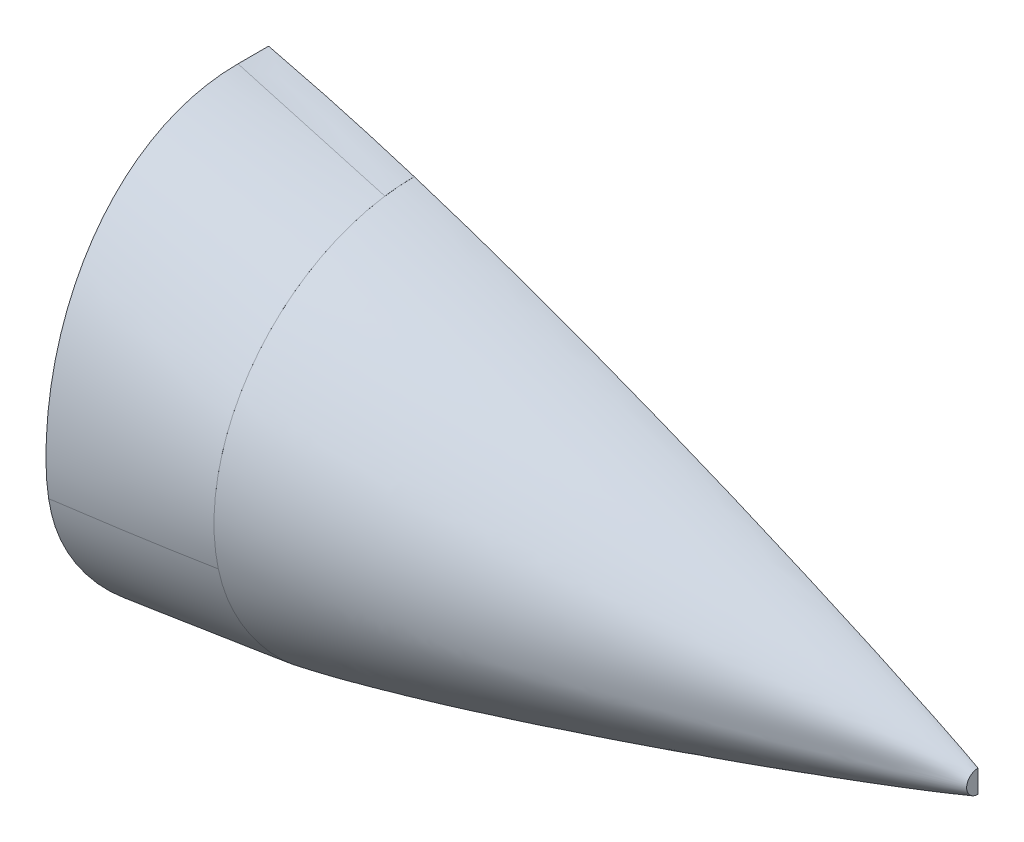
ISO-10303-21;
HEADER;
FILE_DESCRIPTION(('STEP AP214'),'2;1');
FILE_NAME('part.step','',(''),(''),'','','');
FILE_SCHEMA(('AUTOMOTIVE_DESIGN { 1 0 10303 214 1 1 1 1 }'));
ENDSEC;
DATA;
#1=APPLICATION_CONTEXT('core data for automotive mechanical design processes');
#2=APPLICATION_PROTOCOL_DEFINITION('international standard','automotive_design',2000,#1);
#3=PRODUCT_CONTEXT('',#1,'mechanical');
#4=PRODUCT('Part','Part','',(#3));
#5=PRODUCT_RELATED_PRODUCT_CATEGORY('part','',(#4));
#6=PRODUCT_DEFINITION_FORMATION('','',#4);
#7=PRODUCT_DEFINITION_CONTEXT('part definition',#1,'design');
#8=PRODUCT_DEFINITION('design','',#6,#7);
#9=PRODUCT_DEFINITION_SHAPE('','',#8);
#10=(LENGTH_UNIT() NAMED_UNIT(*) SI_UNIT(.MILLI.,.METRE.));
#11=(NAMED_UNIT(*) PLANE_ANGLE_UNIT() SI_UNIT($,.RADIAN.));
#12=(NAMED_UNIT(*) SI_UNIT($,.STERADIAN.) SOLID_ANGLE_UNIT());
#13=UNCERTAINTY_MEASURE_WITH_UNIT(LENGTH_MEASURE(1.E-05),#10,'distance_accuracy_value','');
#14=(GEOMETRIC_REPRESENTATION_CONTEXT(3) GLOBAL_UNCERTAINTY_ASSIGNED_CONTEXT((#13)) GLOBAL_UNIT_ASSIGNED_CONTEXT((#10,
#11,#12)) REPRESENTATION_CONTEXT('',''));
#15=CARTESIAN_POINT('',(0.,0.,0.));
#16=DIRECTION('',(0.,0.,1.));
#17=DIRECTION('',(1.,0.,0.));
#18=AXIS2_PLACEMENT_3D('',#15,#16,#17);
#19=CARTESIAN_POINT('',(-298.,21.8803522951843,0.));
#20=DIRECTION('',(1.,0.,0.));
#21=DIRECTION('',(0.,0.,-1.));
#22=AXIS2_PLACEMENT_3D('',#19,#20,#21);
#23=PLANE('',#22);
#24=CARTESIAN_POINT('',(-298.,21.8803522951843,0.));
#25=DIRECTION('',(1.,0.,0.));
#26=DIRECTION('',(0.,0.,-1.));
#27=AXIS2_PLACEMENT_3D('',#24,#25,#26);
#28=CIRCLE('',#27,105.875304585579);
#29=CARTESIAN_POINT('',(-298.,127.755656880763,0.));
#30=VERTEX_POINT('',#29);
#31=CARTESIAN_POINT('',(-298.,126.612367960943,15.517876924713));
#32=VERTEX_POINT('',#31);
#33=EDGE_CURVE('E221',#30,#32,#28,.T.);
#34=ORIENTED_EDGE('',*,*,#33,.T.);
#35=CARTESIAN_POINT('',(-298.,0.,103.58972103702));
#36=VERTEX_POINT('',#35);
#37=EDGE_CURVE('E420',#32,#36,#28,.T.);
#38=ORIENTED_EDGE('',*,*,#37,.T.);
#39=CARTESIAN_POINT('',(-298.,0.,103.58972103702));
#40=CARTESIAN_POINT('',(-298.,-25.8369696754393,98.1324035244402));
#41=CARTESIAN_POINT('',(-298.,-49.9724926348293,84.6198862908715));
#42=CARTESIAN_POINT('',(-298.,-84.6531403014902,53.511844621439));
#43=CARTESIAN_POINT('',(-298.,-84.6531403014902,26.7559223107195));
#44=CARTESIAN_POINT('',(-298.,-84.6531403014902,0.));
#45=B_SPLINE_CURVE_WITH_KNOTS('',5,(#39,#40,#41,#42,#43,#44),.UNSPECIFIED.,.F.,.F.,(6,6),(0.,
1.),.UNSPECIFIED.);
#46=CARTESIAN_POINT('',(-298.,-83.2847291885327,22.7266796139267));
#47=VERTEX_POINT('',#46);
#48=EDGE_CURVE('E14',#36,#47,#45,.T.);
#49=ORIENTED_EDGE('',*,*,#48,.T.);
#50=CARTESIAN_POINT('',(-298.,-84.6531403014902,0.));
#51=VERTEX_POINT('',#50);
#52=EDGE_CURVE('E227',#47,#51,#45,.T.);
#53=ORIENTED_EDGE('',*,*,#52,.T.);
#54=DIRECTION('',(0.,1.,0.));
#55=VECTOR('',#54,1.);
#56=CARTESIAN_POINT('',(-298.,127.755656880763,0.));
#57=LINE('',#56,#55);
#58=EDGE_CURVE('E361',#51,#30,#57,.T.);
#59=ORIENTED_EDGE('',*,*,#58,.T.);
#60=EDGE_LOOP('',(#34,#38,#49,#53,#59));
#61=FACE_BOUND('',#60,.T.);
#62=ADVANCED_FACE('F217',(#61),#23,.T.);
#63=CARTESIAN_POINT('',(-375.,45.9723136287186,115.82718943613));
#64=DIRECTION('',(-1.,0.,0.));
#65=DIRECTION('',(0.,0.,1.));
#66=AXIS2_PLACEMENT_3D('',#63,#64,#65);
#67=PLANE('',#66);
#68=DIRECTION('',(0.,1.,0.));
#69=VECTOR('',#68,1.);
#70=CARTESIAN_POINT('',(-375.,149.020722765673,0.));
#71=LINE('',#70,#69);
#72=CARTESIAN_POINT('',(-375.,-88.1343350088633,0.));
#73=VERTEX_POINT('',#72);
#74=CARTESIAN_POINT('',(-375.,149.020722765673,0.));
#75=VERTEX_POINT('',#74);
#76=EDGE_CURVE('E272',#73,#75,#71,.T.);
#77=ORIENTED_EDGE('',*,*,#76,.F.);
#78=DIRECTION('',(0.,0.,-1.));
#79=VECTOR('',#78,1.);
#80=CARTESIAN_POINT('',(-375.,-88.1343350088633,0.));
#81=LINE('',#80,#79);
#82=CARTESIAN_POINT('',(-375.,-88.1343350088633,25.7106356519084));
#83=VERTEX_POINT('',#82);
#84=EDGE_CURVE('E293',#83,#73,#81,.T.);
#85=ORIENTED_EDGE('',*,*,#84,.F.);
#86=CARTESIAN_POINT('',(-375.,149.020722765673,16.1819946014525));
#87=CARTESIAN_POINT('',(-375.,149.020722765673,78.2610655109661));
#88=CARTESIAN_POINT('',(-375.,81.4798669683241,123.20084440007));
#89=CARTESIAN_POINT('',(-375.,-43.6078333273814,113.769802053719));
#90=CARTESIAN_POINT('',(-375.,-88.1343350088635,55.1295275424927));
#91=CARTESIAN_POINT('',(-375.,-88.1343350088632,25.710645932688));
#92=B_SPLINE_CURVE_WITH_KNOTS('',3,(#86,#87,#88,#89,#90,#91),.UNSPECIFIED.,.F.,.F.,(4,1,1,4),
(0.,0.564203443043134,0.664203443043134,1.),.UNSPECIFIED.);
#93=CARTESIAN_POINT('',(-375.,1.40573149141031E-05,116.281589855067));
#94=VERTEX_POINT('',#93);
#95=EDGE_CURVE('E322',#94,#83,#92,.T.);
#96=ORIENTED_EDGE('',*,*,#95,.F.);
#97=CARTESIAN_POINT('',(-375.,149.020722765673,16.1819946014525));
#98=VERTEX_POINT('',#97);
#99=EDGE_CURVE('E275',#98,#94,#92,.T.);
#100=ORIENTED_EDGE('',*,*,#99,.F.);
#101=DIRECTION('',(0.,0.,1.));
#102=VECTOR('',#101,1.);
#103=CARTESIAN_POINT('',(-375.,149.020722765673,0.));
#104=LINE('',#103,#102);
#105=EDGE_CURVE('E267',#75,#98,#104,.T.);
#106=ORIENTED_EDGE('',*,*,#105,.F.);
#107=EDGE_LOOP('',(#77,#85,#96,#100,#106));
#108=FACE_BOUND('',#107,.T.);
#109=ADVANCED_FACE('F270',(#108),#67,.T.);
#110=CARTESIAN_POINT('',(-375.,-88.1343350088633,0.));
#111=DIRECTION('',(0.,0.,-1.));
#112=DIRECTION('',(0.,1.,0.));
#113=AXIS2_PLACEMENT_3D('',#110,#111,#112);
#114=PLANE('',#113);
#115=ORIENTED_EDGE('',*,*,#76,.T.);
#116=CARTESIAN_POINT('',(-375.,149.020722765673,0.));
#117=CARTESIAN_POINT('',(-367.721685722693,147.232845332263,0.));
#118=CARTESIAN_POINT('',(-345.76188360626,141.883147468627,0.));
#119=CARTESIAN_POINT('',(-319.679732322623,134.475193261209,0.));
#120=CARTESIAN_POINT('',(-301.335386984583,128.801637004612,0.));
#121=CARTESIAN_POINT('',(-298.,127.755656880763,0.));
#122=B_SPLINE_CURVE_WITH_KNOTS('',3,(#116,#117,#118,#119,#120,#121),.UNSPECIFIED.,.F.,.F.,(4,1,
1,4),(0.,0.306077724219159,0.874058034978004,1.),.UNSPECIFIED.);
#123=EDGE_CURVE('E291',#75,#30,#122,.T.);
#124=ORIENTED_EDGE('',*,*,#123,.T.);
#125=ORIENTED_EDGE('',*,*,#58,.F.);
#126=CARTESIAN_POINT('',(-375.,-88.1343350088633,0.));
#127=CARTESIAN_POINT('',(-367.263026478276,-87.9754985417402,0.));
#128=CARTESIAN_POINT('',(-345.102664069663,-87.3831319282829,0.));
#129=CARTESIAN_POINT('',(-319.416413686394,-86.1576559348939,0.));
#130=CARTESIAN_POINT('',(-301.289291001695,-84.9090646034481,0.));
#131=CARTESIAN_POINT('',(-298.,-84.6531403014901,0.));
#132=B_SPLINE_CURVE_WITH_KNOTS('',3,(#126,#127,#128,#129,#130,#131),.UNSPECIFIED.,.F.,.F.,(4,1,
1,4),(0.,0.306077724219159,0.874058034978004,1.),.UNSPECIFIED.);
#133=EDGE_CURVE('E281',#51,#73,#132,.F.);
#134=ORIENTED_EDGE('',*,*,#133,.T.);
#135=EDGE_LOOP('',(#115,#124,#125,#134));
#136=FACE_BOUND('',#135,.T.);
#137=ADVANCED_FACE('F289',(#136),#114,.T.);
#138=CARTESIAN_POINT('',(-375.,149.020722765673,0.));
#139=CARTESIAN_POINT('',(-367.721685722693,147.232845332263,0.));
#140=CARTESIAN_POINT('',(-345.76188360626,141.883147468627,0.));
#141=CARTESIAN_POINT('',(-319.679732322623,134.475193261209,0.));
#142=CARTESIAN_POINT('',(-301.335386984583,128.801637004612,0.));
#143=CARTESIAN_POINT('',(-298.,127.755656880763,0.));
#144=CARTESIAN_POINT('',(-375.,149.020722765673,1.38331375425079));
#145=CARTESIAN_POINT('',(-367.721685722693,147.232845332263,1.37144902318387));
#146=CARTESIAN_POINT('',(-345.76188360626,141.883147468627,1.33756722551843));
#147=CARTESIAN_POINT('',(-319.679732322623,134.475193261209,1.29880344060992));
#148=CARTESIAN_POINT('',(-301.335386984583,128.801637004612,1.27190438676832));
#149=CARTESIAN_POINT('',(-298.,127.755656880763,1.26702239952525));
#150=CARTESIAN_POINT('',(-375.000000000001,149.020722765673,4.07406651195549));
#151=CARTESIAN_POINT('',(-367.649475642154,147.180457120964,4.05291814682764));
#152=CARTESIAN_POINT('',(-345.630379261387,141.711668597512,3.99252532172478));
#153=CARTESIAN_POINT('',(-319.600163554871,134.328392207337,3.92343056750246));
#154=CARTESIAN_POINT('',(-301.322527415956,128.738586914606,3.87548417840798));
#155=CARTESIAN_POINT('',(-298.,127.709840740324,3.8667822492885));
#156=CARTESIAN_POINT('',(-374.999999999999,149.020722765673,8.02458562112274));
#157=CARTESIAN_POINT('',(-367.432845400533,147.014795946623,8.00730348805958));
#158=CARTESIAN_POINT('',(-345.235866226767,141.164472098641,7.95795135926959));
#159=CARTESIAN_POINT('',(-319.361457251615,133.82746973907,7.9014881419373));
#160=CARTESIAN_POINT('',(-301.283948710074,128.469654457255,7.86230705766817));
#161=CARTESIAN_POINT('',(-298.000000000001,127.489114055632,7.85519596912588));
#162=CARTESIAN_POINT('',(-375.000000000001,149.020722765673,12.0026174457109));
#163=CARTESIAN_POINT('',(-367.216215158915,146.834067399837,11.9813525993304));
#164=CARTESIAN_POINT('',(-344.841353192146,140.55918073166,11.9206271418055));
#165=CARTESIAN_POINT('',(-319.122750948358,133.219225127223,11.8511518265577));
#166=CARTESIAN_POINT('',(-301.245370004192,128.059239953299,11.8029413576904));
#167=CARTESIAN_POINT('',(-298.,127.12070554453,11.7941914999676));
#168=CARTESIAN_POINT('',(-375.,149.020722765673,14.7529618524389));
#169=CARTESIAN_POINT('',(-367.144005078375,146.752822405916,14.7072114327921));
#170=CARTESIAN_POINT('',(-344.709848847273,140.276439529533,14.5765631734395));
#171=CARTESIAN_POINT('',(-319.043182180606,132.866882478158,14.4270899644255));
#172=CARTESIAN_POINT('',(-301.232510435565,127.725225786539,14.3233671750583));
#173=CARTESIAN_POINT('',(-298.,126.792051611546,14.3045422253969));
#174=CARTESIAN_POINT('',(-375.,149.020722765673,16.1819944608377));
#175=CARTESIAN_POINT('',(-367.144005078375,146.734480729662,16.1142358901422));
#176=CARTESIAN_POINT('',(-344.709848847273,140.205720015115,15.9207395378475));
#177=CARTESIAN_POINT('',(-319.043182180606,132.73623806623,15.6993625301989));
#178=CARTESIAN_POINT('',(-301.232510435565,127.552998153355,15.5457440932458));
#179=CARTESIAN_POINT('',(-298.,126.612276919016,15.5178634378918));
#180=B_SPLINE_SURFACE_WITH_KNOTS('',3,3,((#138,#139,#140,#141,#142,#143),(#144,#145,#146,#147,
#148,#149),(#150,#151,#152,#153,#154,#155),(#156,#157,#158,#159,#160,#161),(#162,#163,#164,#165,
#166,#167),(#168,#169,#170,#171,#172,#173),(#174,#175,#176,#177,#178,#179)),.UNSPECIFIED.,.F.,
.F.,.F.,(4,1,1,1,4),(4,1,1,4),(0.,0.25,0.5,0.75,1.),(0.,0.306077724219159,0.874058034978004,1.),.UNSPECIFIED.);
#181=DIRECTION('',(0.960134120357367,-0.279417057682546,-0.00828123188984669));
#182=VECTOR('',#181,1.);
#183=CARTESIAN_POINT('',(-336.5,137.816499842345,15.8499289493648));
#184=LINE('',#183,#182);
#185=EDGE_CURVE('E299',#98,#32,#184,.T.);
#186=ORIENTED_EDGE('',*,*,#105,.T.);
#187=ORIENTED_EDGE('',*,*,#185,.T.);
#188=ORIENTED_EDGE('',*,*,#33,.F.);
#189=ORIENTED_EDGE('',*,*,#123,.F.);
#190=EDGE_LOOP('',(#186,#187,#188,#189));
#191=FACE_BOUND('',#190,.T.);
#192=ADVANCED_FACE('F297',(#191),#180,.T.);
#193=CARTESIAN_POINT('',(-375.,-88.1343350088633,25.7106356519084));
#194=CARTESIAN_POINT('',(-367.144005078375,-87.6395713600442,25.4061984624039));
#195=CARTESIAN_POINT('',(-344.709848847273,-86.2266879371537,24.5368252588774));
#196=CARTESIAN_POINT('',(-319.043182180606,-84.610223850846,23.5421851220261));
#197=CARTESIAN_POINT('',(-301.232510435565,-83.4885234133575,22.8519821746792));
#198=CARTESIAN_POINT('',(-298.,-83.2849427499404,22.7267152413544));
#199=CARTESIAN_POINT('',(-375.,-88.1343350088633,23.5905553585616));
#200=CARTESIAN_POINT('',(-367.144005078375,-87.671824272536,23.3092444052356));
#201=CARTESIAN_POINT('',(-344.709848847273,-86.3510446359854,22.5059121806865));
#202=CARTESIAN_POINT('',(-319.043182180606,-84.839955459185,21.5868287875919));
#203=CARTESIAN_POINT('',(-301.232510435565,-83.7913770187119,20.9490563478234));
#204=CARTESIAN_POINT('',(-298.,-83.6010674784622,20.833305179278));
#205=CARTESIAN_POINT('',(-374.999999999999,-88.1343350088633,19.3109725495547));
#206=CARTESIAN_POINT('',(-367.158882753362,-87.7469765697694,19.0813352559075));
#207=CARTESIAN_POINT('',(-344.758950750071,-86.6234596630403,18.4255661300916));
#208=CARTESIAN_POINT('',(-319.089836118829,-85.2695870653088,17.6753080241383));
#209=CARTESIAN_POINT('',(-301.23960800633,-84.2803289310239,17.1546872118321));
#210=CARTESIAN_POINT('',(-298.,-84.0971213747682,17.0601982316946));
#211=CARTESIAN_POINT('',(-375.,-88.1343350088632,12.8344934360703));
#212=CARTESIAN_POINT('',(-367.203515778326,-87.8619036484591,12.689625520125));
#213=CARTESIAN_POINT('',(-344.906256458468,-87.0145378771998,12.2759300567735));
#214=CARTESIAN_POINT('',(-319.229797933501,-85.7711982013565,11.8026257145029));
#215=CARTESIAN_POINT('',(-301.26090071863,-84.7093139833274,11.4741892881776));
#216=CARTESIAN_POINT('',(-298.000000000001,-84.5019326177303,11.4145804092586));
#217=CARTESIAN_POINT('',(-375.,-88.1343350088632,6.36801159556492));
#218=CARTESIAN_POINT('',(-367.248148803288,-87.9508237147219,6.30494865797548));
#219=CARTESIAN_POINT('',(-345.053562166864,-87.3053415436664,6.12486150053862));
#220=CARTESIAN_POINT('',(-319.369759748171,-86.0875661351209,5.91882580241545));
#221=CARTESIAN_POINT('',(-301.282193430929,-84.8940941911842,5.77585304188172));
#222=CARTESIAN_POINT('',(-298.,-84.6518378969212,5.74990450119541));
#223=CARTESIAN_POINT('',(-375.,-88.1343350088633,2.10773962359426));
#224=CARTESIAN_POINT('',(-367.263026478276,-87.9754985417402,2.08966179081748));
#225=CARTESIAN_POINT('',(-345.102664069663,-87.3831319282829,2.03803740346996));
#226=CARTESIAN_POINT('',(-319.416413686394,-86.1576559348939,1.97897452059307));
#227=CARTESIAN_POINT('',(-301.289291001695,-84.9090646034481,1.93798947049295));
#228=CARTESIAN_POINT('',(-298.,-84.6531403014902,1.93055097496357));
#229=CARTESIAN_POINT('',(-375.,-88.1343350088633,0.));
#230=CARTESIAN_POINT('',(-367.263026478276,-87.9754985417402,0.));
#231=CARTESIAN_POINT('',(-345.102664069663,-87.3831319282829,0.));
#232=CARTESIAN_POINT('',(-319.416413686394,-86.1576559348939,0.));
#233=CARTESIAN_POINT('',(-301.289291001695,-84.9090646034481,0.));
#234=CARTESIAN_POINT('',(-298.,-84.6531403014902,0.));
#235=B_SPLINE_SURFACE_WITH_KNOTS('',3,3,((#193,#194,#195,#196,#197,#198),(#199,#200,#201,#202,
#203,#204),(#205,#206,#207,#208,#209,#210),(#211,#212,#213,#214,#215,#216),(#217,#218,#219,#220,
#221,#222),(#223,#224,#225,#226,#227,#228),(#229,#230,#231,#232,#233,#234)),.UNSPECIFIED.,.F.,
.F.,.F.,(4,1,1,1,4),(4,1,1,4),(0.,0.25,0.5,0.75,1.),(0.,0.306077724219159,0.874058034978004,1.),.UNSPECIFIED.);
#236=DIRECTION('',(0.997277109904833,0.0628076350230332,-0.0386466951067962));
#237=VECTOR('',#236,1.);
#238=CARTESIAN_POINT('',(-336.5,-85.7096388794018,24.2186754466314));
#239=LINE('',#238,#237);
#240=EDGE_CURVE('E475',#83,#47,#239,.T.);
#241=ORIENTED_EDGE('',*,*,#84,.T.);
#242=ORIENTED_EDGE('',*,*,#133,.F.);
#243=ORIENTED_EDGE('',*,*,#52,.F.);
#244=ORIENTED_EDGE('',*,*,#240,.F.);
#245=EDGE_LOOP('',(#241,#242,#243,#244));
#246=FACE_BOUND('',#245,.T.);
#247=ADVANCED_FACE('F388',(#246),#235,.T.);
#248=CARTESIAN_POINT('',(-375.,149.020722765673,16.1819944608377));
#249=CARTESIAN_POINT('',(-367.144005078375,146.734480729662,16.1142358901422));
#250=CARTESIAN_POINT('',(-344.709848847273,140.205720015115,15.9207395378475));
#251=CARTESIAN_POINT('',(-319.043182180606,132.73623806623,15.6993625301989));
#252=CARTESIAN_POINT('',(-301.232510435565,127.552998153355,15.5457440932458));
#253=CARTESIAN_POINT('',(-298.,126.612276919016,15.5178634378918));
#254=CARTESIAN_POINT('',(-375.,149.020722765673,20.3963513107022));
#255=CARTESIAN_POINT('',(-367.144005078375,146.680389333493,20.2636885512707));
#256=CARTESIAN_POINT('',(-344.709848847273,139.997161254277,19.8848470294994));
#257=CARTESIAN_POINT('',(-319.043182180606,132.350954924985,19.451418691093));
#258=CARTESIAN_POINT('',(-301.232510435565,127.045082027873,19.1506531121182));
#259=CARTESIAN_POINT('',(-298.,126.082103777799,19.096066295483));
#260=CARTESIAN_POINT('',(-375.,148.490437511013,28.8387252588574));
#261=CARTESIAN_POINT('',(-367.143465905174,146.05867366364,28.5693303293077));
#262=CARTESIAN_POINT('',(-344.708237812321,139.114350487571,27.7991965620658));
#263=CARTESIAN_POINT('',(-319.041865399227,131.169428184736,26.9152736891567));
#264=CARTESIAN_POINT('',(-301.232283183594,125.656269619451,26.2990644338289));
#265=CARTESIAN_POINT('',(-298.,124.655670533173,26.1871240966212));
#266=CARTESIAN_POINT('',(-375.000000000001,145.957082382871,41.3086748578389));
#267=CARTESIAN_POINT('',(-367.141241815719,143.456963779735,40.8264266013461));
#268=CARTESIAN_POINT('',(-344.701592293143,136.317443035168,39.445030247329));
#269=CARTESIAN_POINT('',(-319.036433676038,128.149197382295,37.8501301673314));
#270=CARTESIAN_POINT('',(-301.231345769215,122.481069769716,36.7288616199889));
#271=CARTESIAN_POINT('',(-298.,121.452345068915,36.524832832364));
#272=CARTESIAN_POINT('',(-374.999999999999,141.6325982457,53.3057104001688));
#273=CARTESIAN_POINT('',(-367.137804586558,139.141872102157,52.6204333435068));
#274=CARTESIAN_POINT('',(-344.691321945322,132.029175154525,50.6539629580476));
#275=CARTESIAN_POINT('',(-319.028039194745,123.891618307043,48.3716994125272));
#276=CARTESIAN_POINT('',(-301.229897037902,118.244786340142,46.7553778360331));
#277=CARTESIAN_POINT('',(-298.,117.219926905911,46.4608455132578));
#278=CARTESIAN_POINT('',(-375.000000000001,135.582830449893,64.5550429078042));
#279=CARTESIAN_POINT('',(-367.133356407649,133.177818517359,63.6946004908604));
#280=CARTESIAN_POINT('',(-344.678030906968,126.309895954943,61.2210690556356));
#281=CARTESIAN_POINT('',(-319.017175748367,118.45238273777,58.3354055799127));
#282=CARTESIAN_POINT('',(-301.228022209144,112.999879284132,56.2769786097591));
#283=CARTESIAN_POINT('',(-298.,112.010289429023,55.9013597463387));
#284=CARTESIAN_POINT('',(-374.999999999998,127.982546402909,74.8347704298914));
#285=CARTESIAN_POINT('',(-367.128099468933,125.727032097079,73.8396691586925));
#286=CARTESIAN_POINT('',(-344.662323316182,119.28602899795,70.9735053047018));
#287=CARTESIAN_POINT('',(-319.004337129919,111.916949553139,67.6111262187879));
#288=CARTESIAN_POINT('',(-301.22580650243,106.803381174385,65.1942497010072));
#289=CARTESIAN_POINT('',(-298.000000000001,105.875306023114,64.752573138643));
#290=CARTESIAN_POINT('',(-375.000000000001,119.066882219417,84.0058820297995));
#291=CARTESIAN_POINT('',(-367.122235960371,117.007475429632,82.9219451205133));
#292=CARTESIAN_POINT('',(-344.644803311079,111.126494770759,79.7930714476673));
#293=CARTESIAN_POINT('',(-318.990017132421,104.398130722232,76.0994455962286));
#294=CARTESIAN_POINT('',(-301.223335137249,99.7291690293964,73.4218736833549));
#295=CARTESIAN_POINT('',(-298.000000000001,98.8817872744661,72.93176553132));
#296=CARTESIAN_POINT('',(-375.,109.091952109841,92.0073779666045));
#297=CARTESIAN_POINT('',(-367.115968071904,107.255948889817,90.877786182458));
#298=CARTESIAN_POINT('',(-344.626075029758,102.012939522685,87.6088904887693));
#299=CARTESIAN_POINT('',(-318.974709548886,96.0144712776522,83.7222675092247));
#300=CARTESIAN_POINT('',(-301.220693333089,91.8520005418599,80.8778080914737));
#301=CARTESIAN_POINT('',(-298.,91.0965437693622,80.3562167655189));
#302=CARTESIAN_POINT('',(-375.,94.6807106904916,101.116061949094));
#303=CARTESIAN_POINT('',(-367.107341300682,93.1591761878043,99.9731974641079));
#304=CARTESIAN_POINT('',(-344.600298470523,88.814191809923,96.6531222214416));
#305=CARTESIAN_POINT('',(-318.953641046818,83.8431438886135,92.6628018907439));
#306=CARTESIAN_POINT('',(-301.217057301558,80.3936230020428,89.7010168311857));
#307=CARTESIAN_POINT('',(-297.999999999999,79.7675622118349,89.1564879984094));
#308=CARTESIAN_POINT('',(-375.,79.0261184937984,107.94749995627));
#309=CARTESIAN_POINT('',(-367.09871452946,77.8170968348665,106.841328638111));
#310=CARTESIAN_POINT('',(-344.574521911288,74.3645521099483,103.612760048868));
#311=CARTESIAN_POINT('',(-318.932572544752,70.4145343917255,99.681988051732));
#312=CARTESIAN_POINT('',(-301.213421270028,67.6735291073216,96.7161571674154));
#313=CARTESIAN_POINT('',(-298.000000000001,67.1760595150538,96.169250310132));
#314=CARTESIAN_POINT('',(-375.,62.7285480576479,112.711517099523));
#315=CARTESIAN_POINT('',(-367.090896518041,61.8061447827271,111.646600039354));
#316=CARTESIAN_POINT('',(-344.551161904481,59.1720931187881,108.523807813912));
#317=CARTESIAN_POINT('',(-318.913479214753,56.1585041366729,104.673142160045));
#318=CARTESIAN_POINT('',(-301.210126116453,54.0673076119354,101.721784337466));
#319=CARTESIAN_POINT('',(-298.,53.6877742818798,101.176014602313));
#320=CARTESIAN_POINT('',(-375.,50.2809929011512,115.307054045058));
#321=CARTESIAN_POINT('',(-367.085639579327,49.5609513151788,114.265326364187));
#322=CARTESIAN_POINT('',(-344.535454313697,47.5047816142779,111.200664731882));
#323=CARTESIAN_POINT('',(-318.900640596305,45.1523409082639,107.388996376879));
#324=CARTESIAN_POINT('',(-301.207910409739,43.5199298999072,104.437053682175));
#325=CARTESIAN_POINT('',(-298.,43.2236632776779,103.890176145232));
#326=CARTESIAN_POINT('',(-375.,39.8048265593104,116.695223495998));
#327=CARTESIAN_POINT('',(-367.081932763568,39.2429147078079,115.658723007653));
#328=CARTESIAN_POINT('',(-344.524378448401,37.6383140496277,112.603283548172));
#329=CARTESIAN_POINT('',(-318.891587724323,35.8025084234938,108.7827686218));
#330=CARTESIAN_POINT('',(-301.206348052441,34.5286020055157,105.80519314342));
#331=CARTESIAN_POINT('',(-298.,34.2974016988044,105.252957145444));
#332=CARTESIAN_POINT('',(-375.,31.3964344169725,117.364849602134));
#333=CARTESIAN_POINT('',(-367.079472785837,30.9566722502209,116.320385563924));
#334=CARTESIAN_POINT('',(-344.517028101431,29.7008926363034,113.238418772799));
#335=CARTESIAN_POINT('',(-318.88557990928,28.2641692567751,109.374681300178));
#336=CARTESIAN_POINT('',(-301.205311215325,27.2671948995852,106.354175839559));
#337=CARTESIAN_POINT('',(-298.,27.0862559799458,105.793679633076));
#338=CARTESIAN_POINT('',(-375.,25.0870650947,117.649506761966));
#339=CARTESIAN_POINT('',(-367.077905813721,24.7370173825261,116.59239165421));
#340=CARTESIAN_POINT('',(-344.512346031102,23.7374338673367,113.47188588794));
#341=CARTESIAN_POINT('',(-318.881753013397,22.593821572514,109.555856529951));
#342=CARTESIAN_POINT('',(-301.204650764285,21.8002435262797,106.4908239406));
#343=CARTESIAN_POINT('',(-298.,21.6562197102877,105.921947807229));
#344=CARTESIAN_POINT('',(-374.999999999999,18.780115242977,117.727714243712));
#345=CARTESIAN_POINT('',(-367.076642126529,18.5186898350486,116.649825206799));
#346=CARTESIAN_POINT('',(-344.508570167932,17.772183417455,113.468051002009));
#347=CARTESIAN_POINT('',(-318.878666807039,16.9181137931053,109.475312307148));
#348=CARTESIAN_POINT('',(-301.204118142479,16.3254558557012,106.350403735156));
#349=CARTESIAN_POINT('',(-298.,16.2178977074812,105.77041975451));
#350=CARTESIAN_POINT('',(-375.000000000001,10.3884073206583,117.515268147314));
#351=CARTESIAN_POINT('',(-367.075395288502,10.2441160623786,116.402999643394));
#352=CARTESIAN_POINT('',(-344.504844649605,9.8321072529081,113.121129958418));
#353=CARTESIAN_POINT('',(-318.8756217501,9.36073259243616,109.007348514258));
#354=CARTESIAN_POINT('',(-301.203592622296,9.03363521529605,105.791888626049));
#355=CARTESIAN_POINT('',(-298.,8.9742745164606,105.195232653352));
#356=CARTESIAN_POINT('',(-375.,4.12799288858758,116.925026798162));
#357=CARTESIAN_POINT('',(-367.074990908601,4.07092575960125,115.788256617807));
#358=CARTESIAN_POINT('',(-344.503636373391,3.90820897025956,112.434188793595));
#359=CARTESIAN_POINT('',(-318.874634164066,3.72252932466083,108.232784941062));
#360=CARTESIAN_POINT('',(-301.203422183318,3.59406924478479,104.952589244642));
#361=CARTESIAN_POINT('',(-298.,3.57079955154066,104.343949848345));
#362=CARTESIAN_POINT('',(-375.,1.40573149141031E-05,116.281589855067));
#363=CARTESIAN_POINT('',(-367.0749909086,0.,115.132237645445));
#364=CARTESIAN_POINT('',(-344.503636373391,0.,111.74384664446));
#365=CARTESIAN_POINT('',(-318.874634164066,0.,107.506079259703));
#366=CARTESIAN_POINT('',(-301.203422183318,0.,104.202456152621));
#367=CARTESIAN_POINT('',(-298.,5.18253236636221E-06,103.589722131681));
#368=B_SPLINE_SURFACE_WITH_KNOTS('',3,3,((#248,#249,#250,#251,#252,#253),(#254,#255,#256,#257,
#258,#259),(#260,#261,#262,#263,#264,#265),(#266,#267,#268,#269,#270,#271),(#272,#273,#274,#275,
#276,#277),(#278,#279,#280,#281,#282,#283),(#284,#285,#286,#287,#288,#289),(#290,#291,#292,#293,
#294,#295),(#296,#297,#298,#299,#300,#301),(#302,#303,#304,#305,#306,#307),(#308,#309,#310,#311,
#312,#313),(#314,#315,#316,#317,#318,#319),(#320,#321,#322,#323,#324,#325),(#326,#327,#328,#329,
#330,#331),(#332,#333,#334,#335,#336,#337),(#338,#339,#340,#341,#342,#343),(#344,#345,#346,#347,
#348,#349),(#350,#351,#352,#353,#354,#355),(#356,#357,#358,#359,#360,#361),(#362,#363,#364,#365,
#366,#367)),.UNSPECIFIED.,.F.,.F.,.F.,(4,1,1,1,1,1,1,1,1,1,1,1,1,1,1,1,1,4),(4,1,1,4),(0.,
0.0625,0.125,0.1875,0.25,0.3125,0.375,0.4375,0.5,0.625,0.6875,0.75,0.8125,0.84375,0.875,0.90625,
0.9375,1.),(0.,0.306077724219159,0.874058034978004,1.),.UNSPECIFIED.);
#369=CARTESIAN_POINT('',(-375.,1.40573149141031E-05,116.281589855067));
#370=CARTESIAN_POINT('',(-367.0749909086,0.,115.132237645445));
#371=CARTESIAN_POINT('',(-344.503636373391,0.,111.74384664446));
#372=CARTESIAN_POINT('',(-318.874634164066,0.,107.506079259703));
#373=CARTESIAN_POINT('',(-301.203422183318,0.,104.202456152621));
#374=CARTESIAN_POINT('',(-298.,5.18253236636221E-06,103.589722131681));
#375=B_SPLINE_CURVE_WITH_KNOTS('',3,(#369,#370,#371,#372,#373,#374),.UNSPECIFIED.,.F.,.F.,(4,1,
1,4),(0.,0.306077724219159,0.874058034978004,1.),.UNSPECIFIED.);
#376=EDGE_CURVE('E301',#94,#36,#375,.T.);
#377=ORIENTED_EDGE('',*,*,#99,.T.);
#378=ORIENTED_EDGE('',*,*,#376,.T.);
#379=ORIENTED_EDGE('',*,*,#37,.F.);
#380=ORIENTED_EDGE('',*,*,#185,.F.);
#381=EDGE_LOOP('',(#377,#378,#379,#380));
#382=FACE_BOUND('',#381,.T.);
#383=ADVANCED_FACE('F339',(#382),#368,.T.);
#384=CARTESIAN_POINT('',(-375.,1.40573149141031E-05,116.281589855067));
#385=CARTESIAN_POINT('',(-367.0749909086,0.,115.132237645445));
#386=CARTESIAN_POINT('',(-344.503636373391,0.,111.74384664446));
#387=CARTESIAN_POINT('',(-318.874634164066,0.,107.506079259703));
#388=CARTESIAN_POINT('',(-301.203422183318,0.,104.202456152621));
#389=CARTESIAN_POINT('',(-298.,5.18253236636221E-06,103.589722131681));
#390=CARTESIAN_POINT('',(-375.,-2.83133675242118,115.840261111799));
#391=CARTESIAN_POINT('',(-367.0749909086,-2.7922185207207,114.682278979348));
#392=CARTESIAN_POINT('',(-344.503636373391,-2.68061225235274,111.270345959781));
#393=CARTESIAN_POINT('',(-318.874634164066,-2.55325592704053,107.007637091402));
#394=CARTESIAN_POINT('',(-301.203422183318,-2.4651460878087,103.687945292872));
#395=CARTESIAN_POINT('',(-298.,-2.44917683640151,103.072402798519));
#396=CARTESIAN_POINT('',(-375.,-7.03973965558467,115.002336438289));
#397=CARTESIAN_POINT('',(-367.075395288502,-6.94369314784956,113.833008089219));
#398=CARTESIAN_POINT('',(-344.504844649605,-6.67003406819,110.393292295695));
#399=CARTESIAN_POINT('',(-318.8756217501,-6.35848101621192,106.108136066879));
#400=CARTESIAN_POINT('',(-301.203592622296,-6.14351782614033,102.779484169067));
#401=CARTESIAN_POINT('',(-298.,-6.1046239464519,102.16278367628));
#402=CARTESIAN_POINT('',(-375.,-12.5320461952809,113.48896295482));
#403=CARTESIAN_POINT('',(-367.07664212653,-12.3659334061851,112.316075019998));
#404=CARTESIAN_POINT('',(-344.508570167932,-11.8925900558499,108.871222015063));
#405=CARTESIAN_POINT('',(-318.87866680704,-11.3535178689759,104.592332383797));
#406=CARTESIAN_POINT('',(-301.204118142478,-10.9814243854235,101.278079462835));
#407=CARTESIAN_POINT('',(-298.,-10.9140891361097,100.664534157896));
#408=CARTESIAN_POINT('',(-374.999999999999,-17.9262669013326,111.696848737217));
#409=CARTESIAN_POINT('',(-367.078327042783,-17.6950296475209,110.529298587118));
#410=CARTESIAN_POINT('',(-344.513604652157,-17.0360533371257,107.104916932491));
#411=CARTESIAN_POINT('',(-318.882781748849,-16.2853951450241,102.863028665688));
#412=CARTESIAN_POINT('',(-301.204828304886,-15.7671134095924,99.5862738577299));
#413=CARTESIAN_POINT('',(-298.,-15.6733110607384,98.9801131785843));
#414=CARTESIAN_POINT('',(-375.000000000001,-24.4668211814423,108.965500264132));
#415=CARTESIAN_POINT('',(-367.081191400417,-24.1639160368597,107.818979104024));
#416=CARTESIAN_POINT('',(-344.522163275342,-23.3005982127317,104.461512132308));
#417=CARTESIAN_POINT('',(-318.889777149927,-22.3168952386196,100.315605586012));
#418=CARTESIAN_POINT('',(-301.206035580981,-21.6374908816884,97.1232760781014));
#419=CARTESIAN_POINT('',(-298.,-21.5145065856771,96.5332240035438));
#420=CARTESIAN_POINT('',(-375.,-31.9666388776291,105.024734729432));
#421=CARTESIAN_POINT('',(-367.085639579327,-31.5929355327502,103.918547498914));
#422=CARTESIAN_POINT('',(-344.535454313697,-30.5276705978387,100.684863842497));
#423=CARTESIAN_POINT('',(-318.900640596305,-29.3134519203608,96.7070289675637));
#424=CARTESIAN_POINT('',(-301.207910409739,-28.474511575541,93.656694980739));
#425=CARTESIAN_POINT('',(-298.,-28.3226162337116,93.0934335978384));
#426=CARTESIAN_POINT('',(-375.000000000001,-39.1071813121914,100.517290836747));
#427=CARTESIAN_POINT('',(-367.090896518041,-38.6768601741658,99.4622445574571));
#428=CARTESIAN_POINT('',(-344.551161904481,-37.450009773801,96.3834168503546));
#429=CARTESIAN_POINT('',(-318.913479214753,-36.0511410975661,92.6115677514333));
#430=CARTESIAN_POINT('',(-301.210126116453,-35.0842425909835,89.7326307157325));
#431=CARTESIAN_POINT('',(-298.,-34.9091419629157,89.2015491216171));
#432=CARTESIAN_POINT('',(-374.999999999999,-45.8850769797676,95.5192356971539));
#433=CARTESIAN_POINT('',(-367.096760026605,-45.4107922535593,94.5221580794322));
#434=CARTESIAN_POINT('',(-344.568681909586,-44.0583795960087,91.6177391732839));
#435=CARTESIAN_POINT('',(-318.927799212251,-42.5158098086203,88.0758324438777));
#436=CARTESIAN_POINT('',(-301.212597481634,-41.4491564887544,85.3871192406402));
#437=CARTESIAN_POINT('',(-298.,-41.2559476929671,84.8916639749652));
#438=CARTESIAN_POINT('',(-375.000000000001,-52.2980414003603,90.0898876614497));
#439=CARTESIAN_POINT('',(-367.103027915072,-51.7908101839981,89.1553359118172));
#440=CARTESIAN_POINT('',(-344.587410190906,-50.3442033327147,86.4382386720506));
#441=CARTESIAN_POINT('',(-318.943106795786,-48.6936021629832,83.1418563146104));
#442=CARTESIAN_POINT('',(-301.215239285794,-47.551771463629,80.6554933890939));
#443=CARTESIAN_POINT('',(-298.,-47.3448973435436,80.1978715579677));
#444=CARTESIAN_POINT('',(-375.,-60.3558632306502,82.3303045472899));
#445=CARTESIAN_POINT('',(-367.111654686293,-59.8161716494794,81.4821096418935));
#446=CARTESIAN_POINT('',(-344.613186750141,-58.2766245303298,79.0229673600577));
#447=CARTESIAN_POINT('',(-318.964175297853,-56.5191097860502,76.0633649568989));
#448=CARTESIAN_POINT('',(-301.218875317325,-55.3026238141398,73.8539012405249));
#449=CARTESIAN_POINT('',(-298.000000000001,-55.0821534290499,73.4479895648755));
#450=CARTESIAN_POINT('',(-375.000000000001,-69.4802538083505,71.7410643201977));
#451=CARTESIAN_POINT('',(-367.122438150321,-68.9166973335505,71.002294003119));
#452=CARTESIAN_POINT('',(-344.645407449185,-67.3085613516273,68.8687842119366));
#453=CARTESIAN_POINT('',(-318.990510925436,-65.4715361870444,66.3319370725924));
#454=CARTESIAN_POINT('',(-301.223420356736,-64.1990448033401,64.4686715346604));
#455=CARTESIAN_POINT('',(-297.999999999999,-63.9683258023859,64.1273098602658));
#456=CARTESIAN_POINT('',(-375.,-77.1860067991846,60.0713904668914));
#457=CARTESIAN_POINT('',(-367.131873681344,-76.6040403457496,59.4380844322372));
#458=CARTESIAN_POINT('',(-344.673600560849,-74.9428476938381,57.6164787808654));
#459=CARTESIAN_POINT('',(-319.013554599574,-73.0439784494829,55.4790041491149));
#460=CARTESIAN_POINT('',(-301.227397266225,-71.7276575852116,53.9382351857341));
#461=CARTESIAN_POINT('',(-298.000000000001,-71.4888912281066,53.6568312880936));
#462=CARTESIAN_POINT('',(-375.,-82.2363573753302,50.0894823490944));
#463=CARTESIAN_POINT('',(-367.137804586559,-81.6405838905061,49.5426977659376));
#464=CARTESIAN_POINT('',(-344.691321945322,-79.9396282735649,47.9746791162964));
#465=CARTESIAN_POINT('',(-319.028039194744,-77.9944772764906,46.1536345012798));
#466=CARTESIAN_POINT('',(-301.229897037901,-76.6454086394538,44.8606918951068));
#467=CARTESIAN_POINT('',(-297.999999999999,-76.4006347602733,44.6251405333512));
#468=CARTESIAN_POINT('',(-375.,-85.3260361126964,42.2733251297863));
#469=CARTESIAN_POINT('',(-367.141241815718,-84.7261778688403,41.7967503325378));
#470=CARTESIAN_POINT('',(-344.701592293143,-83.0133526851106,40.4329161876664));
#471=CARTESIAN_POINT('',(-319.036433676039,-81.0541388675924,38.8605682907774));
#472=CARTESIAN_POINT('',(-301.231345769216,-79.6949251437945,37.7564781681858));
#473=CARTESIAN_POINT('',(-298.000000000001,-79.4482708104039,37.5557003285959));
#474=CARTESIAN_POINT('',(-375.,-87.5142883201529,34.1361275349327));
#475=CARTESIAN_POINT('',(-367.143465905174,-86.9305589604842,33.7391981170985));
#476=CARTESIAN_POINT('',(-344.70823781232,-85.2636537876292,32.6051430730572));
#477=CARTESIAN_POINT('',(-319.041865399226,-83.3566493583633,31.3053600645344));
#478=CARTESIAN_POINT('',(-301.232283183593,-82.0334030136821,30.4008858607912));
#479=CARTESIAN_POINT('',(-297.999999999999,-81.7932499462312,30.2366544569864));
#480=CARTESIAN_POINT('',(-375.,-88.1343350088633,28.5251368200126));
#481=CARTESIAN_POINT('',(-367.144005078375,-87.59675417988,28.189998520299));
#482=CARTESIAN_POINT('',(-344.709848847273,-86.0615988717906,27.2329529710326));
#483=CARTESIAN_POINT('',(-319.043182180606,-84.3052448922426,26.1380078861899));
#484=CARTESIAN_POINT('',(-301.232510435565,-83.086471741678,25.3782011010609));
#485=CARTESIAN_POINT('',(-298.,-82.8652730702195,25.2403015654846));
#486=CARTESIAN_POINT('',(-375.,-88.1343350088633,25.7106356519084));
#487=CARTESIAN_POINT('',(-367.144005078375,-87.6395713600442,25.4061984624039));
#488=CARTESIAN_POINT('',(-344.709848847273,-86.2266879371537,24.5368252588774));
#489=CARTESIAN_POINT('',(-319.043182180606,-84.610223850846,23.5421851220261));
#490=CARTESIAN_POINT('',(-301.232510435565,-83.4885234133575,22.8519821746792));
#491=CARTESIAN_POINT('',(-298.,-83.2849427499404,22.7267152413544));
#492=B_SPLINE_SURFACE_WITH_KNOTS('',3,3,((#384,#385,#386,#387,#388,#389),(#390,#391,#392,#393,
#394,#395),(#396,#397,#398,#399,#400,#401),(#402,#403,#404,#405,#406,#407),(#408,#409,#410,#411,
#412,#413),(#414,#415,#416,#417,#418,#419),(#420,#421,#422,#423,#424,#425),(#426,#427,#428,#429,
#430,#431),(#432,#433,#434,#435,#436,#437),(#438,#439,#440,#441,#442,#443),(#444,#445,#446,#447,
#448,#449),(#450,#451,#452,#453,#454,#455),(#456,#457,#458,#459,#460,#461),(#462,#463,#464,#465,
#466,#467),(#468,#469,#470,#471,#472,#473),(#474,#475,#476,#477,#478,#479),(#480,#481,#482,#483,
#484,#485),(#486,#487,#488,#489,#490,#491)),.UNSPECIFIED.,.F.,.F.,.F.,(4,1,1,1,1,1,1,1,1,1,1,1,
1,1,1,4),(4,1,1,4),(0.,0.0625000000000002,0.09375,0.125,0.1875,0.25,0.3125,0.375,0.4375,0.5,
0.625,0.75,0.8125,0.875,0.9375,1.),(0.,0.306077724219159,0.874058034978004,1.),.UNSPECIFIED.);
#493=ORIENTED_EDGE('',*,*,#95,.T.);
#494=ORIENTED_EDGE('',*,*,#240,.T.);
#495=ORIENTED_EDGE('',*,*,#48,.F.);
#496=ORIENTED_EDGE('',*,*,#376,.F.);
#497=EDGE_LOOP('',(#493,#494,#495,#496));
#498=FACE_BOUND('',#497,.T.);
#499=ADVANCED_FACE('F328',(#498),#492,.T.);
#500=CLOSED_SHELL('',(#62,#109,#137,#192,#247,#383,#499));
#501=MANIFOLD_SOLID_BREP('B2',#500);
#502=CARTESIAN_POINT('',(0.,0.,0.));
#503=DIRECTION('',(1.,0.,0.));
#504=DIRECTION('',(0.,0.,-1.));
#505=AXIS2_PLACEMENT_3D('',#502,#503,#504);
#506=PLANE('',#505);
#507=CARTESIAN_POINT('',(0.,0.,0.));
#508=DIRECTION('',(1.,0.,0.));
#509=DIRECTION('',(0.,0.,-1.));
#510=AXIS2_PLACEMENT_3D('',#507,#508,#509);
#511=CIRCLE('',#510,6.);
#512=CARTESIAN_POINT('',(0.,6.,0.));
#513=VERTEX_POINT('',#512);
#514=CARTESIAN_POINT('',(0.,-6.,0.));
#515=VERTEX_POINT('',#514);
#516=EDGE_CURVE('E641',#513,#515,#511,.T.);
#517=ORIENTED_EDGE('',*,*,#516,.T.);
#518=DIRECTION('',(0.,1.,0.));
#519=VECTOR('',#518,1.);
#520=CARTESIAN_POINT('',(0.,-6.,0.));
#521=LINE('',#520,#519);
#522=EDGE_CURVE('E215',#515,#513,#521,.T.);
#523=ORIENTED_EDGE('',*,*,#522,.T.);
#524=EDGE_LOOP('',(#517,#523));
#525=FACE_BOUND('',#524,.T.);
#526=ADVANCED_FACE('F631',(#525),#506,.T.);
#527=CARTESIAN_POINT('',(-298.,21.8803522951843,0.));
#528=DIRECTION('',(1.,0.,0.));
#529=DIRECTION('',(0.,0.,-1.));
#530=AXIS2_PLACEMENT_3D('',#527,#528,#529);
#531=PLANE('',#530);
#532=CARTESIAN_POINT('',(-298.,21.8803522951843,0.));
#533=DIRECTION('',(1.,0.,0.));
#534=DIRECTION('',(0.,0.,-1.));
#535=AXIS2_PLACEMENT_3D('',#532,#533,#534);
#536=CIRCLE('',#535,105.875304585579);
#537=CARTESIAN_POINT('',(-298.,127.755656880763,0.));
#538=VERTEX_POINT('',#537);
#539=CARTESIAN_POINT('',(-298.,0.,103.58972103702));
#540=VERTEX_POINT('',#539);
#541=EDGE_CURVE('E669',#538,#540,#536,.T.);
#542=ORIENTED_EDGE('',*,*,#541,.F.);
#543=DIRECTION('',(0.,1.,0.));
#544=VECTOR('',#543,1.);
#545=CARTESIAN_POINT('',(-298.,127.755656880763,0.));
#546=LINE('',#545,#544);
#547=CARTESIAN_POINT('',(-298.,-84.6531403014902,0.));
#548=VERTEX_POINT('',#547);
#549=EDGE_CURVE('E673',#548,#538,#546,.T.);
#550=ORIENTED_EDGE('',*,*,#549,.F.);
#551=CARTESIAN_POINT('',(-298.,0.,103.58972103702));
#552=CARTESIAN_POINT('',(-298.,-25.8369696754393,98.1324035244402));
#553=CARTESIAN_POINT('',(-298.,-49.9724926348293,84.6198862908715));
#554=CARTESIAN_POINT('',(-298.,-84.6531403014902,53.511844621439));
#555=CARTESIAN_POINT('',(-298.,-84.6531403014902,26.7559223107195));
#556=CARTESIAN_POINT('',(-298.,-84.6531403014902,0.));
#557=B_SPLINE_CURVE_WITH_KNOTS('',5,(#551,#552,#553,#554,#555,#556),.UNSPECIFIED.,.F.,.F.,(6,6),
(0.,1.),.UNSPECIFIED.);
#558=EDGE_CURVE('E679',#540,#548,#557,.T.);
#559=ORIENTED_EDGE('',*,*,#558,.F.);
#560=EDGE_LOOP('',(#542,#550,#559));
#561=FACE_BOUND('',#560,.T.);
#562=ADVANCED_FACE('F683',(#561),#531,.F.);
#563=CARTESIAN_POINT('',(-298.,127.755656880763,0.));
#564=CARTESIAN_POINT('',(-291.218159581643,125.62886609928,0.));
#565=CARTESIAN_POINT('',(-277.604713414422,121.240754563883,0.));
#566=CARTESIAN_POINT('',(-141.168793219035,75.1018885826891,0.));
#567=CARTESIAN_POINT('',(-15.0959851589305,14.8002275852707,0.));
#568=CARTESIAN_POINT('',(0.,6.,0.));
#569=CARTESIAN_POINT('',(-298.,127.755656880763,7.40001814196608));
#570=CARTESIAN_POINT('',(-291.218159581643,125.62886609928,7.28365109192882));
#571=CARTESIAN_POINT('',(-277.604713414422,121.240754563883,7.05091699185336));
#572=CARTESIAN_POINT('',(-141.168793219035,75.1018885826891,4.72357599110812));
#573=CARTESIAN_POINT('',(-15.0959851589305,14.8002275852707,2.51260204040016));
#574=CARTESIAN_POINT('',(0.,6.,0.417995139730388));
#575=CARTESIAN_POINT('',(-298.,126.19638511097,22.5060279356232));
#576=CARTESIAN_POINT('',(-291.28787265787,124.098401944172,22.1692981580792));
#577=CARTESIAN_POINT('',(-277.815884296052,119.771927178636,21.4947440829568));
#578=CARTESIAN_POINT('',(-142.813651796476,74.3081903147643,14.7540618419114));
#579=CARTESIAN_POINT('',(-18.0810627120347,15.1477916735525,8.04697207865511));
#580=CARTESIAN_POINT('',(0.,5.91360834010273,1.23205934812549));
#581=CARTESIAN_POINT('',(-297.999999999999,118.763417237753,44.8641484251061));
#582=CARTESIAN_POINT('',(-291.549296693716,116.79886901152,44.2427034943272));
#583=CARTESIAN_POINT('',(-278.607775102164,112.754413241417,42.9944029865263));
#584=CARTESIAN_POINT('',(-148.981871461879,70.3356441351611,30.5186046786483));
#585=CARTESIAN_POINT('',(-29.2751035361748,15.9480973293507,17.1977396047018));
#586=CARTESIAN_POINT('',(0.,5.55558644865516,2.3638449467288));
#587=CARTESIAN_POINT('',(-298.000000000001,106.241008554379,65.4946371028235));
#588=CARTESIAN_POINT('',(-291.915290343905,104.496905056438,64.6464861585001));
#589=CARTESIAN_POINT('',(-279.716422230723,100.914656842878,62.9383923651787));
#590=CARTESIAN_POINT('',(-157.617378993445,63.4397281997002,45.8425549209942));
#591=CARTESIAN_POINT('',(-44.9467606899719,16.3898890623086,26.4570573315374));
#592=CARTESIAN_POINT('',(0.,4.99987073369611,3.38278733055047));
#593=CARTESIAN_POINT('',(-297.999999999999,89.152407561566,82.9656217261573));
#594=CARTESIAN_POINT('',(-292.333568801261,87.7037529772319,81.9610890963548));
#595=CARTESIAN_POINT('',(-280.983447520502,84.7369418585939,79.9323947553575));
#596=CARTESIAN_POINT('',(-167.48653045809,53.795487575748,59.5644759765041));
#597=CARTESIAN_POINT('',(-62.8572260085962,15.9850639112815,35.0847978012582));
#598=CARTESIAN_POINT('',(0.,4.2683185695523,4.2683185695523));
#599=CARTESIAN_POINT('',(-298.,68.5270214823913,96.074742088916));
#600=CARTESIAN_POINT('',(-292.751847258618,67.4283784158599,94.9926420894682));
#601=CARTESIAN_POINT('',(-282.250472810283,65.1864029503768,92.8001291281114));
#602=CARTESIAN_POINT('',(-177.355681922737,41.8900985427898,70.6644636751963));
#603=CARTESIAN_POINT('',(-80.767691327221,14.3973665318314,42.409687166888));
#604=CARTESIAN_POINT('',(0.,3.38278733055047,4.99987073369611));
#605=CARTESIAN_POINT('',(-298.000000000001,45.7539934377845,104.063294898683));
#606=CARTESIAN_POINT('',(-293.117840908806,45.0334658230981,102.983516060558));
#607=CARTESIAN_POINT('',(-283.359119938842,43.5698594107868,100.786724050361));
#608=CARTESIAN_POINT('',(-185.991189454302,28.432080230344,78.3957079902731));
#609=CARTESIAN_POINT('',(-96.4393484810179,11.3975597378745,47.8926460445814));
#610=CARTESIAN_POINT('',(0.,2.3638449467288,5.55558644865516));
#611=CARTESIAN_POINT('',(-297.999999999999,22.3424204578093,106.715240190312));
#612=CARTESIAN_POINT('',(-293.379264944652,21.9996543270372,105.709700870822));
#613=CARTESIAN_POINT('',(-284.151010744953,21.3080867460607,103.652838249934));
#614=CARTESIAN_POINT('',(-192.159409119705,14.2039233452278,82.346041280086));
#615=CARTESIAN_POINT('',(-107.633389305158,6.79239251606716,51.1573940486737));
#616=CARTESIAN_POINT('',(0.,1.23205934812549,5.91360834010273));
#617=CARTESIAN_POINT('',(-298.,7.24027022161289,105.119020098503));
#618=CARTESIAN_POINT('',(-293.448978020879,7.13141682284538,104.199880855457));
#619=CARTESIAN_POINT('',(-284.362181626584,6.91297187895939,102.310772580453));
#620=CARTESIAN_POINT('',(-193.804267697147,4.68134928651276,82.3901160543456));
#621=CARTESIAN_POINT('',(-110.618466858262,2.50214931328175,51.7013607942569));
#622=CARTESIAN_POINT('',(0.,0.41799513973039,6.));
#623=CARTESIAN_POINT('',(-298.,-3.18197800098882,102.917619606877));
#624=CARTESIAN_POINT('',(-293.448978020879,-3.13413221621424,102.068500708343));
#625=CARTESIAN_POINT('',(-284.362181626584,-3.03812950691965,100.316182946321));
#626=CARTESIAN_POINT('',(-193.804267697147,-2.05737064298496,81.5197382626856));
#627=CARTESIAN_POINT('',(-110.618466858262,-1.09965059781848,51.4765991386342));
#628=CARTESIAN_POINT('',(0.,-0.183701509278387,6.));
#629=CARTESIAN_POINT('',(-298.,-9.38882172939198,101.294970453022));
#630=CARTESIAN_POINT('',(-293.461612940708,-9.25591265418181,100.48451097387));
#631=CARTESIAN_POINT('',(-284.400039897362,-8.98886332997909,98.8081902769108));
#632=CARTESIAN_POINT('',(-193.985975476667,-6.21899084192995,80.6508806575));
#633=CARTESIAN_POINT('',(-110.067121679091,-3.1712078424402,51.0834453980923));
#634=CARTESIAN_POINT('',(0.,-0.555613504025418,5.98281604011808));
#635=CARTESIAN_POINT('',(-298.,-18.2001050116895,98.0464148979528));
#636=CARTESIAN_POINT('',(-293.513731984999,-17.9687825154513,97.28420922758));
#637=CARTESIAN_POINT('',(-284.55620526432,-17.5028005713035,95.7041766519415));
#638=CARTESIAN_POINT('',(-194.735520067188,-12.528508747866,78.4036504078415));
#639=CARTESIAN_POINT('',(-107.792822815012,-5.91321146540095,49.7878720873737));
#640=CARTESIAN_POINT('',(0.,-1.12011415614905,5.9035598051604));
#641=CARTESIAN_POINT('',(-298.,-26.5173012744901,94.1044228873561));
#642=CARTESIAN_POINT('',(-293.594279598906,-26.2135283824487,93.3816148122663));
#643=CARTESIAN_POINT('',(-284.797551740528,-25.5999263981231,91.8816957940625));
#644=CARTESIAN_POINT('',(-195.893907161631,-18.8516489893586,75.3426192057392));
#645=CARTESIAN_POINT('',(-104.277997297799,-8.31755297968005,47.8784630453977));
#646=CARTESIAN_POINT('',(0.,-1.68435319970807,5.76889485957887));
#647=CARTESIAN_POINT('',(-298.,-34.3639682882667,89.5802801899048));
#648=CARTESIAN_POINT('',(-293.69851768749,-34.0101784949189,88.8890569300698));
#649=CARTESIAN_POINT('',(-285.109882474444,-33.2933222448771,87.454938471137));
#650=CARTESIAN_POINT('',(-197.392996342673,-25.1464548235712,71.5918498539103));
#651=CARTESIAN_POINT('',(-99.7293995696399,-10.4175012644664,45.4442673607869));
#652=CARTESIAN_POINT('',(0.,-2.2414363661348,5.57689278788442));
#653=CARTESIAN_POINT('',(-298.,-41.7653526721112,84.5545470072224));
#654=CARTESIAN_POINT('',(-293.821708155816,-41.3804217937485,83.8886513088655));
#655=CARTESIAN_POINT('',(-285.479000614527,-40.5976739521929,82.5089061623308));
#656=CARTESIAN_POINT('',(-199.164647192997,-31.3720109643153,67.2564577220582));
#657=CARTESIAN_POINT('',(-94.3537840727251,-12.2468318535347,42.5651164520491));
#658=CARTESIAN_POINT('',(0.,-2.78446938686157,5.32562517458802));
#659=CARTESIAN_POINT('',(-298.000000000001,-48.7327849422384,79.0737241374443));
#660=CARTESIAN_POINT('',(-293.959112908951,-48.3322471322072,78.4291116432421));
#661=CARTESIAN_POINT('',(-285.890709309236,-47.5143993036002,77.0965130539265));
#662=CARTESIAN_POINT('',(-201.140719295281,-37.4784543735018,62.4226182910353));
#663=CARTESIAN_POINT('',(-88.3579052492436,-13.8344768186954,39.3143918826727));
#664=CARTESIAN_POINT('',(0.,-3.30560280603351,5.0185464128103));
#665=CARTESIAN_POINT('',(-297.999999999999,-55.2683220423687,73.15845192));
#666=CARTESIAN_POINT('',(-294.105993851954,-54.8645243506114,72.5337221767267));
#667=CARTESIAN_POINT('',(-286.330811707026,-54.0361061887591,71.246105896436));
#668=CARTESIAN_POINT('',(-203.253072232204,-43.4102033100031,57.1605597588255));
#669=CARTESIAN_POINT('',(-81.9485175413832,-15.2065861600108,35.7577170785339));
#670=CARTESIAN_POINT('',(0.,-3.79698716779578,4.65911089567193));
#671=CARTESIAN_POINT('',(-298.000000000001,-63.3674739747898,64.6941251634342));
#672=CARTESIAN_POINT('',(-294.308152569209,-62.9722393677725,64.0979895523798));
#673=CARTESIAN_POINT('',(-286.936544039471,-62.1554770291049,62.875065755475));
#674=CARTESIAN_POINT('',(-206.160396704531,-50.9864026689679,49.6514035750642));
#675=CARTESIAN_POINT('',(-73.1269946746517,-16.7710171469051,30.6873827244702));
#676=CARTESIAN_POINT('',(0.,-4.40203496579279,4.11466038983407));
#677=CARTESIAN_POINT('',(-298.,-70.478234322228,55.3375041020321));
#678=CARTESIAN_POINT('',(-294.510311286463,-70.1057223032186,54.7795032825921));
#679=CARTESIAN_POINT('',(-287.542276371915,-69.329054926717,53.640725399529));
#680=CARTESIAN_POINT('',(-209.067721176856,-57.9089748891321,41.5013818510783));
#681=CARTESIAN_POINT('',(-64.3054718079196,-17.9691281803961,25.2358545142208));
#682=CARTESIAN_POINT('',(0.,-4.91618682555107,3.47931394575749));
#683=CARTESIAN_POINT('',(-298.,-76.2546322135171,45.0132968474591));
#684=CARTESIAN_POINT('',(-294.693517623975,-75.9124501871182,44.5164709870382));
#685=CARTESIAN_POINT('',(-288.091221298192,-75.1916617390371,43.5073902594428));
#686=CARTESIAN_POINT('',(-211.702483979901,-63.7439096037822,32.9008036399303));
#687=CARTESIAN_POINT('',(-56.3109667099439,-18.8115658425741,19.6305763531315));
#688=CARTESIAN_POINT('',(0.,-5.32562517458802,2.78446938686157));
#689=CARTESIAN_POINT('',(-298.,-79.7822685938805,36.7844146678262));
#690=CARTESIAN_POINT('',(-294.816708092301,-79.465849541112,36.3480834985415));
#691=CARTESIAN_POINT('',(-288.460339438275,-78.7933980823661,35.4650127334869));
#692=CARTESIAN_POINT('',(-213.474134830224,-67.4363466384547,26.2830840880662));
#693=CARTESIAN_POINT('',(-50.9353512130291,-19.2529226214024,15.4116705322207));
#694=CARTESIAN_POINT('',(0.,-5.57689278788442,2.24143636613481));
#695=CARTESIAN_POINT('',(-298.,-82.3848347772678,28.0990146691025));
#696=CARTESIAN_POINT('',(-294.920946180886,-82.0961214099869,27.7403660082999));
#697=CARTESIAN_POINT('',(-288.772670172192,-81.4764014551175,27.0169656914622));
#698=CARTESIAN_POINT('',(-214.973224011267,-70.3156025581335,19.5752755725105));
#699=CARTESIAN_POINT('',(-46.3867534848705,-19.4962949456238,11.2490880550612));
#700=CARTESIAN_POINT('',(0.,-5.76889485957886,1.68435319970807));
#701=CARTESIAN_POINT('',(-298.,-83.9824192161351,19.0278678571727));
#702=CARTESIAN_POINT('',(-295.001493794791,-83.721696248839,18.7659552464462));
#703=CARTESIAN_POINT('',(-289.0140166484,-83.1558985738173,18.2393920107855));
#704=CARTESIAN_POINT('',(-216.131611105709,-72.2792965694268,12.8798388211491));
#705=CARTESIAN_POINT('',(-42.8719279676569,-19.5500867778618,7.22589946027905));
#706=CARTESIAN_POINT('',(0.,-5.9035598051604,1.12011415614905));
#707=CARTESIAN_POINT('',(-298.,-84.6431126468533,9.66126704489923));
#708=CARTESIAN_POINT('',(-295.053612839084,-84.4065400919469,9.51668438664112));
#709=CARTESIAN_POINT('',(-289.170182015358,-83.8877183247109,9.22698028550236));
#710=CARTESIAN_POINT('',(-216.881155696231,-73.3163159540235,6.31127300950438));
#711=CARTESIAN_POINT('',(-40.5976291035778,-19.4671027659146,3.43103182859332));
#712=CARTESIAN_POINT('',(0.,-5.98281604011808,0.555613504025421));
#713=CARTESIAN_POINT('',(-298.,-84.6531403014902,3.2521845475277));
#714=CARTESIAN_POINT('',(-295.066247758912,-84.4248788025741,3.20104316355688));
#715=CARTESIAN_POINT('',(-289.208040286136,-83.9223597755089,3.09876039561482));
#716=CARTESIAN_POINT('',(-217.062863475751,-73.4742094021,2.07593271619838));
#717=CARTESIAN_POINT('',(-40.0462839244069,-19.4004289582947,1.10424642075277));
#718=CARTESIAN_POINT('',(0.,-6.,0.18370150927839));
#719=CARTESIAN_POINT('',(-298.,-84.6531403014902,0.));
#720=CARTESIAN_POINT('',(-295.066247758912,-84.4248788025741,0.));
#721=CARTESIAN_POINT('',(-289.208040286136,-83.9223597755089,0.));
#722=CARTESIAN_POINT('',(-217.062863475751,-73.4742094021,0.));
#723=CARTESIAN_POINT('',(-40.0462839244069,-19.4004289582947,0.));
#724=CARTESIAN_POINT('',(0.,-6.,0.));
#725=B_SPLINE_SURFACE_WITH_KNOTS('',3,3,((#563,#564,#565,#566,#567,#568),(#569,#570,#571,#572,
#573,#574),(#575,#576,#577,#578,#579,#580),(#581,#582,#583,#584,#585,#586),(#587,#588,#589,#590,
#591,#592),(#593,#594,#595,#596,#597,#598),(#599,#600,#601,#602,#603,#604),(#605,#606,#607,#608,
#609,#610),(#611,#612,#613,#614,#615,#616),(#617,#618,#619,#620,#621,#622),(#623,#624,#625,#626,
#627,#628),(#629,#630,#631,#632,#633,#634),(#635,#636,#637,#638,#639,#640),(#641,#642,#643,#644,
#645,#646),(#647,#648,#649,#650,#651,#652),(#653,#654,#655,#656,#657,#658),(#659,#660,#661,#662,
#663,#664),(#665,#666,#667,#668,#669,#670),(#671,#672,#673,#674,#675,#676),(#677,#678,#679,#680,
#681,#682),(#683,#684,#685,#686,#687,#688),(#689,#690,#691,#692,#693,#694),(#695,#696,#697,#698,
#699,#700),(#701,#702,#703,#704,#705,#706),(#707,#708,#709,#710,#711,#712),(#713,#714,#715,#716,
#717,#718),(#719,#720,#721,#722,#723,#724)),.UNSPECIFIED.,.F.,.F.,.F.,(4,1,1,1,1,1,1,1,2,1,1,1,
1,1,1,1,1,1,1,1,1,1,1,4),(4,1,1,4),(0.,0.0665259931093379,0.133051986218676,0.199577979328014,
0.266103972437352,0.332629965546689,0.399155958656027,0.465681951765365,0.532207944874703,
0.561444948320034,0.590681951765365,0.619918955210696,0.649155958656027,0.678392962101358,
0.707629965546689,0.736866968992021,0.766103972437352,0.824577979328014,0.853814982773345,
0.883051986218676,0.912288989664007,0.941525993109338,0.970762996554669,1.),(0.,
0.0500000000000007,0.100000000000404,1.),.UNSPECIFIED.);
#726=CARTESIAN_POINT('',(-298.,-84.6531403014902,0.));
#727=CARTESIAN_POINT('',(-295.066247758912,-84.4248788025741,0.));
#728=CARTESIAN_POINT('',(-289.208040286136,-83.9223597755089,0.));
#729=CARTESIAN_POINT('',(-217.062863475751,-73.4742094021,0.));
#730=CARTESIAN_POINT('',(-40.0462839244069,-19.4004289582947,0.));
#731=CARTESIAN_POINT('',(0.,-6.,0.));
#732=B_SPLINE_CURVE_WITH_KNOTS('',3,(#726,#727,#728,#729,#730,#731),.UNSPECIFIED.,.F.,.F.,(4,1,
1,4),(0.,0.0500000000000007,0.100000000000404,1.),.UNSPECIFIED.);
#733=EDGE_CURVE('E654',#548,#515,#732,.T.);
#734=CARTESIAN_POINT('',(-298.,127.755656880763,0.));
#735=CARTESIAN_POINT('',(-291.218159581643,125.62886609928,0.));
#736=CARTESIAN_POINT('',(-277.604713414422,121.240754563883,0.));
#737=CARTESIAN_POINT('',(-141.168793219035,75.1018885826891,0.));
#738=CARTESIAN_POINT('',(-15.0959851589305,14.8002275852707,0.));
#739=CARTESIAN_POINT('',(0.,6.,0.));
#740=B_SPLINE_CURVE_WITH_KNOTS('',3,(#734,#735,#736,#737,#738,#739),.UNSPECIFIED.,.F.,.F.,(4,1,
1,4),(0.,0.0500000000000007,0.100000000000404,1.),.UNSPECIFIED.);
#741=EDGE_CURVE('E665',#513,#538,#740,.F.);
#742=ORIENTED_EDGE('',*,*,#541,.T.);
#743=ORIENTED_EDGE('',*,*,#558,.T.);
#744=ORIENTED_EDGE('',*,*,#733,.T.);
#745=ORIENTED_EDGE('',*,*,#516,.F.);
#746=ORIENTED_EDGE('',*,*,#741,.T.);
#747=EDGE_LOOP('',(#742,#743,#744,#745,#746));
#748=FACE_BOUND('',#747,.T.);
#749=ADVANCED_FACE('F667',(#748),#725,.T.);
#750=CARTESIAN_POINT('',(-298.,-84.6531403014901,0.));
#751=DIRECTION('',(0.,0.,-1.));
#752=DIRECTION('',(0.,1.,0.));
#753=AXIS2_PLACEMENT_3D('',#750,#751,#752);
#754=PLANE('',#753);
#755=ORIENTED_EDGE('',*,*,#549,.T.);
#756=ORIENTED_EDGE('',*,*,#741,.F.);
#757=ORIENTED_EDGE('',*,*,#522,.F.);
#758=ORIENTED_EDGE('',*,*,#733,.F.);
#759=EDGE_LOOP('',(#755,#756,#757,#758));
#760=FACE_BOUND('',#759,.T.);
#761=ADVANCED_FACE('F676',(#760),#754,.T.);
#762=CLOSED_SHELL('',(#526,#562,#749,#761));
#763=MANIFOLD_SOLID_BREP('B8',#762);
#764=ADVANCED_BREP_SHAPE_REPRESENTATION('',(#18,#501,#763),#14);
#765=SHAPE_DEFINITION_REPRESENTATION(#9,#764);
ENDSEC;
END-ISO-10303-21;
